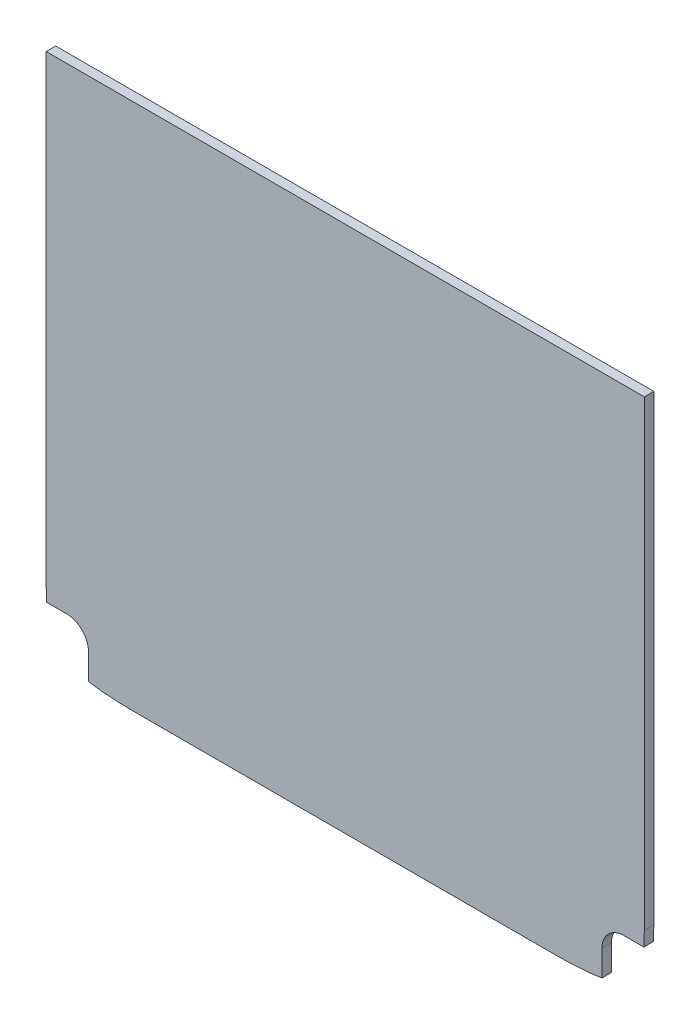
ISO-10303-21;
HEADER;
FILE_DESCRIPTION(('STEP AP214'),'2;1');
FILE_NAME('part.step','',(''),(''),'','','');
FILE_SCHEMA(('AUTOMOTIVE_DESIGN { 1 0 10303 214 1 1 1 1 }'));
ENDSEC;
DATA;
#1=APPLICATION_CONTEXT('core data for automotive mechanical design processes');
#2=APPLICATION_PROTOCOL_DEFINITION('international standard','automotive_design',2000,#1);
#3=PRODUCT_CONTEXT('',#1,'mechanical');
#4=PRODUCT('Part','Part','',(#3));
#5=PRODUCT_RELATED_PRODUCT_CATEGORY('part','',(#4));
#6=PRODUCT_DEFINITION_FORMATION('','',#4);
#7=PRODUCT_DEFINITION_CONTEXT('part definition',#1,'design');
#8=PRODUCT_DEFINITION('design','',#6,#7);
#9=PRODUCT_DEFINITION_SHAPE('','',#8);
#10=(LENGTH_UNIT() NAMED_UNIT(*) SI_UNIT(.MILLI.,.METRE.));
#11=(NAMED_UNIT(*) PLANE_ANGLE_UNIT() SI_UNIT($,.RADIAN.));
#12=(NAMED_UNIT(*) SI_UNIT($,.STERADIAN.) SOLID_ANGLE_UNIT());
#13=UNCERTAINTY_MEASURE_WITH_UNIT(LENGTH_MEASURE(1.E-05),#10,'distance_accuracy_value','');
#14=(GEOMETRIC_REPRESENTATION_CONTEXT(3) GLOBAL_UNCERTAINTY_ASSIGNED_CONTEXT((#13)) GLOBAL_UNIT_ASSIGNED_CONTEXT((#10,
#11,#12)) REPRESENTATION_CONTEXT('',''));
#15=CARTESIAN_POINT('',(0.,0.,0.));
#16=DIRECTION('',(0.,0.,1.));
#17=DIRECTION('',(1.,0.,0.));
#18=AXIS2_PLACEMENT_3D('',#15,#16,#17);
#19=CARTESIAN_POINT('',(-26.9499999999924,-65.5586526538314,2.15));
#20=CARTESIAN_POINT('',(-26.3530525880366,-65.6660159480295,2.15));
#21=CARTESIAN_POINT('',(-25.6657397475612,-65.7491722546854,2.15));
#22=CARTESIAN_POINT('',(-24.0328892150823,-65.8692163600263,2.15));
#23=CARTESIAN_POINT('',(-23.0666253583513,-65.8999999999461,2.15));
#24=CARTESIAN_POINT('',(-21.9999999999962,-65.8999999999461,2.15));
#25=B_SPLINE_CURVE_WITH_KNOTS('',3,(#19,#20,#21,#22,#23,#24),.UNSPECIFIED.,.F.,.F.,(4,2,4),
(0.762959975228664,0.875000000000001,1.),.UNSPECIFIED.);
#26=DIRECTION('',(0.,0.,-1.));
#27=VECTOR('',#26,1.);
#28=SURFACE_OF_LINEAR_EXTRUSION('',#25,#27);
#29=CARTESIAN_POINT('',(-26.9499999999924,-65.5586526538314,1.15));
#30=CARTESIAN_POINT('',(-26.3530525880366,-65.6660159480295,1.15));
#31=CARTESIAN_POINT('',(-25.6657397475612,-65.7491722546854,1.15));
#32=CARTESIAN_POINT('',(-24.0328892150823,-65.8692163600263,1.15));
#33=CARTESIAN_POINT('',(-23.0666253583513,-65.8999999999461,1.15));
#34=CARTESIAN_POINT('',(-21.9999999999962,-65.8999999999461,1.15));
#35=B_SPLINE_CURVE_WITH_KNOTS('',3,(#29,#30,#31,#32,#33,#34),.UNSPECIFIED.,.F.,.F.,(4,2,4),
(0.762959975228664,0.875000000000001,1.),.UNSPECIFIED.);
#36=CARTESIAN_POINT('',(-26.9499999999924,-65.5586526538314,1.15));
#37=VERTEX_POINT('',#36);
#38=CARTESIAN_POINT('',(-21.9999999999962,-65.8999999999461,1.15));
#39=VERTEX_POINT('',#38);
#40=EDGE_CURVE('E166',#37,#39,#35,.T.);
#41=ORIENTED_EDGE('',*,*,#40,.T.);
#42=DIRECTION('',(0.,0.,-1.));
#43=VECTOR('',#42,1.);
#44=CARTESIAN_POINT('',(-21.9999999999962,-65.8999999999461,2.15));
#45=LINE('',#44,#43);
#46=CARTESIAN_POINT('',(-21.9999999999962,-65.8999999999461,2.15));
#47=VERTEX_POINT('',#46);
#48=EDGE_CURVE('E11',#47,#39,#45,.T.);
#49=ORIENTED_EDGE('',*,*,#48,.F.);
#50=CARTESIAN_POINT('',(-26.9499999999924,-65.5586526538314,2.15));
#51=VERTEX_POINT('',#50);
#52=EDGE_CURVE('E212',#51,#47,#25,.T.);
#53=ORIENTED_EDGE('',*,*,#52,.F.);
#54=DIRECTION('',(0.,0.,-1.));
#55=VECTOR('',#54,1.);
#56=CARTESIAN_POINT('',(-26.9499999999924,-65.5586526538314,2.15));
#57=LINE('',#56,#55);
#58=EDGE_CURVE('E162',#51,#37,#57,.T.);
#59=ORIENTED_EDGE('',*,*,#58,.T.);
#60=EDGE_LOOP('',(#41,#49,#53,#59));
#61=FACE_BOUND('',#60,.T.);
#62=ADVANCED_FACE('F33',(#61),#28,.F.);
#63=CARTESIAN_POINT('',(-21.9999999999962,-65.8999999999461,2.15));
#64=DIRECTION('',(0.,1.,0.));
#65=DIRECTION('',(0.,0.,1.));
#66=AXIS2_PLACEMENT_3D('',#63,#64,#65);
#67=PLANE('',#66);
#68=DIRECTION('',(1.,0.,0.));
#69=VECTOR('',#68,1.);
#70=CARTESIAN_POINT('',(-21.9999999999962,-65.8999999999461,1.15));
#71=LINE('',#70,#69);
#72=CARTESIAN_POINT('',(22.0000000000038,-65.8999999999461,1.15));
#73=VERTEX_POINT('',#72);
#74=EDGE_CURVE('E171',#39,#73,#71,.T.);
#75=ORIENTED_EDGE('',*,*,#74,.T.);
#76=DIRECTION('',(0.,0.,-1.));
#77=VECTOR('',#76,1.);
#78=CARTESIAN_POINT('',(22.0000000000038,-65.8999999999461,2.15));
#79=LINE('',#78,#77);
#80=CARTESIAN_POINT('',(22.0000000000038,-65.8999999999461,2.15));
#81=VERTEX_POINT('',#80);
#82=EDGE_CURVE('E42',#81,#73,#79,.T.);
#83=ORIENTED_EDGE('',*,*,#82,.F.);
#84=DIRECTION('',(1.,0.,0.));
#85=VECTOR('',#84,1.);
#86=CARTESIAN_POINT('',(-21.9999999999962,-65.8999999999461,2.15));
#87=LINE('',#86,#85);
#88=EDGE_CURVE('E111',#47,#81,#87,.T.);
#89=ORIENTED_EDGE('',*,*,#88,.F.);
#90=ORIENTED_EDGE('',*,*,#48,.T.);
#91=EDGE_LOOP('',(#75,#83,#89,#90));
#92=FACE_BOUND('',#91,.T.);
#93=ADVANCED_FACE('F296',(#92),#67,.F.);
#94=CARTESIAN_POINT('',(22.0000000000038,-65.8999999999461,2.15));
#95=CARTESIAN_POINT('',(23.0666253583589,-65.8999999999461,2.15));
#96=CARTESIAN_POINT('',(24.0328892150899,-65.8692163600263,2.15));
#97=CARTESIAN_POINT('',(25.6657397475688,-65.7491722546854,2.15));
#98=CARTESIAN_POINT('',(26.3530525880442,-65.6660159480295,2.15));
#99=CARTESIAN_POINT('',(26.95,-65.5586526538314,2.15));
#100=B_SPLINE_CURVE_WITH_KNOTS('',3,(#94,#95,#96,#97,#98,#99),.UNSPECIFIED.,.F.,.F.,(4,2,4),
(0.762959975228664,0.887959975228663,1.),.UNSPECIFIED.);
#101=DIRECTION('',(0.,0.,-1.));
#102=VECTOR('',#101,1.);
#103=SURFACE_OF_LINEAR_EXTRUSION('',#100,#102);
#104=CARTESIAN_POINT('',(22.0000000000038,-65.8999999999461,1.15));
#105=CARTESIAN_POINT('',(23.0666253583589,-65.8999999999461,1.15));
#106=CARTESIAN_POINT('',(24.0328892150899,-65.8692163600263,1.15));
#107=CARTESIAN_POINT('',(25.6657397475688,-65.7491722546854,1.15));
#108=CARTESIAN_POINT('',(26.3530525880442,-65.6660159480295,1.15));
#109=CARTESIAN_POINT('',(26.95,-65.5586526538314,1.15));
#110=B_SPLINE_CURVE_WITH_KNOTS('',3,(#104,#105,#106,#107,#108,#109),.UNSPECIFIED.,.F.,.F.,(4,2,
4),(0.762959975228664,0.887959975228663,1.),.UNSPECIFIED.);
#111=CARTESIAN_POINT('',(26.95,-65.5586526538314,1.15));
#112=VERTEX_POINT('',#111);
#113=EDGE_CURVE('E176',#73,#112,#110,.T.);
#114=ORIENTED_EDGE('',*,*,#113,.T.);
#115=DIRECTION('',(0.,0.,-1.));
#116=VECTOR('',#115,1.);
#117=CARTESIAN_POINT('',(26.95,-65.5586526538314,2.15));
#118=LINE('',#117,#116);
#119=CARTESIAN_POINT('',(26.95,-65.5586526538314,2.15));
#120=VERTEX_POINT('',#119);
#121=EDGE_CURVE('E237',#120,#112,#118,.T.);
#122=ORIENTED_EDGE('',*,*,#121,.F.);
#123=EDGE_CURVE('E245',#81,#120,#100,.T.);
#124=ORIENTED_EDGE('',*,*,#123,.F.);
#125=ORIENTED_EDGE('',*,*,#82,.T.);
#126=EDGE_LOOP('',(#114,#122,#124,#125));
#127=FACE_BOUND('',#126,.T.);
#128=ADVANCED_FACE('F243',(#127),#103,.F.);
#129=CARTESIAN_POINT('',(26.95,-65.5586526538314,2.15));
#130=DIRECTION('',(-1.,0.,0.));
#131=DIRECTION('',(0.,-1.,0.));
#132=AXIS2_PLACEMENT_3D('',#129,#130,#131);
#133=PLANE('',#132);
#134=DIRECTION('',(0.,1.,0.));
#135=VECTOR('',#134,1.);
#136=CARTESIAN_POINT('',(26.95,-65.5586526538314,1.15));
#137=LINE('',#136,#135);
#138=CARTESIAN_POINT('',(26.95,-62.8499999999461,1.15));
#139=VERTEX_POINT('',#138);
#140=EDGE_CURVE('E180',#112,#139,#137,.T.);
#141=ORIENTED_EDGE('',*,*,#140,.T.);
#142=DIRECTION('',(0.,0.,-1.));
#143=VECTOR('',#142,1.);
#144=CARTESIAN_POINT('',(26.95,-62.8499999999461,2.15));
#145=LINE('',#144,#143);
#146=CARTESIAN_POINT('',(26.95,-62.8499999999461,2.15));
#147=VERTEX_POINT('',#146);
#148=EDGE_CURVE('E234',#147,#139,#145,.T.);
#149=ORIENTED_EDGE('',*,*,#148,.F.);
#150=DIRECTION('',(0.,1.,0.));
#151=VECTOR('',#150,1.);
#152=CARTESIAN_POINT('',(26.95,-65.5586526538314,2.15));
#153=LINE('',#152,#151);
#154=EDGE_CURVE('E263',#120,#147,#153,.T.);
#155=ORIENTED_EDGE('',*,*,#154,.F.);
#156=ORIENTED_EDGE('',*,*,#121,.T.);
#157=EDGE_LOOP('',(#141,#149,#155,#156));
#158=FACE_BOUND('',#157,.T.);
#159=ADVANCED_FACE('F254',(#158),#133,.F.);
#160=CARTESIAN_POINT('',(29.25,-62.8499999999461,2.15));
#161=DIRECTION('',(0.,0.,-1.));
#162=DIRECTION('',(-1.,0.,0.));
#163=AXIS2_PLACEMENT_3D('',#160,#161,#162);
#164=CYLINDRICAL_SURFACE('',#163,2.30000000000001);
#165=CARTESIAN_POINT('',(29.25,-62.8499999999461,1.15));
#166=DIRECTION('',(0.,0.,-1.));
#167=DIRECTION('',(1.,0.,0.));
#168=AXIS2_PLACEMENT_3D('',#165,#166,#167);
#169=CIRCLE('',#168,2.30000000000001);
#170=CARTESIAN_POINT('',(29.25,-60.5499999999461,1.15));
#171=VERTEX_POINT('',#170);
#172=EDGE_CURVE('E185',#139,#171,#169,.T.);
#173=ORIENTED_EDGE('',*,*,#172,.T.);
#174=DIRECTION('',(0.,0.,-1.));
#175=VECTOR('',#174,1.);
#176=CARTESIAN_POINT('',(29.25,-60.5499999999461,2.15));
#177=LINE('',#176,#175);
#178=CARTESIAN_POINT('',(29.25,-60.5499999999461,2.15));
#179=VERTEX_POINT('',#178);
#180=EDGE_CURVE('E231',#179,#171,#177,.T.);
#181=ORIENTED_EDGE('',*,*,#180,.F.);
#182=CARTESIAN_POINT('',(29.25,-62.8499999999461,2.15));
#183=DIRECTION('',(0.,0.,-1.));
#184=DIRECTION('',(1.,0.,0.));
#185=AXIS2_PLACEMENT_3D('',#182,#183,#184);
#186=CIRCLE('',#185,2.30000000000001);
#187=EDGE_CURVE('E260',#147,#179,#186,.T.);
#188=ORIENTED_EDGE('',*,*,#187,.F.);
#189=ORIENTED_EDGE('',*,*,#148,.T.);
#190=EDGE_LOOP('',(#173,#181,#188,#189));
#191=FACE_BOUND('',#190,.T.);
#192=ADVANCED_FACE('F258',(#191),#164,.F.);
#193=CARTESIAN_POINT('',(29.25,-60.5499999999461,2.15));
#194=DIRECTION('',(0.,1.,0.));
#195=DIRECTION('',(0.,0.,1.));
#196=AXIS2_PLACEMENT_3D('',#193,#194,#195);
#197=PLANE('',#196);
#198=DIRECTION('',(1.,0.,0.));
#199=VECTOR('',#198,1.);
#200=CARTESIAN_POINT('',(29.25,-60.5499999999461,1.15));
#201=LINE('',#200,#199);
#202=CARTESIAN_POINT('',(31.3422494533232,-60.5499999999461,1.15));
#203=VERTEX_POINT('',#202);
#204=EDGE_CURVE('E187',#171,#203,#201,.T.);
#205=ORIENTED_EDGE('',*,*,#204,.T.);
#206=DIRECTION('',(0.,0.,-1.));
#207=VECTOR('',#206,1.);
#208=CARTESIAN_POINT('',(31.3422494533232,-60.5499999999461,2.15));
#209=LINE('',#208,#207);
#210=CARTESIAN_POINT('',(31.3422494533232,-60.5499999999461,2.15));
#211=VERTEX_POINT('',#210);
#212=EDGE_CURVE('E228',#211,#203,#209,.T.);
#213=ORIENTED_EDGE('',*,*,#212,.F.);
#214=DIRECTION('',(1.,0.,0.));
#215=VECTOR('',#214,1.);
#216=CARTESIAN_POINT('',(29.25,-60.5499999999461,2.15));
#217=LINE('',#216,#215);
#218=EDGE_CURVE('E262',#179,#211,#217,.T.);
#219=ORIENTED_EDGE('',*,*,#218,.F.);
#220=ORIENTED_EDGE('',*,*,#180,.T.);
#221=EDGE_LOOP('',(#205,#213,#219,#220));
#222=FACE_BOUND('',#221,.T.);
#223=ADVANCED_FACE('F285',(#222),#197,.F.);
#224=CARTESIAN_POINT('',(31.3422494533232,-60.5499999999461,2.15));
#225=CARTESIAN_POINT('',(31.3799273594437,-60.0817827199579,2.15));
#226=CARTESIAN_POINT('',(31.4,-59.5647726423221,2.15));
#227=CARTESIAN_POINT('',(31.4,-59.,2.15));
#228=B_SPLINE_CURVE_WITH_KNOTS('',3,(#224,#225,#226,#227),.UNSPECIFIED.,.F.,.F.,(4,4),(0.,
0.0796346763149644),.UNSPECIFIED.);
#229=DIRECTION('',(0.,0.,-1.));
#230=VECTOR('',#229,1.);
#231=SURFACE_OF_LINEAR_EXTRUSION('',#228,#230);
#232=CARTESIAN_POINT('',(31.3422494533232,-60.5499999999461,1.15));
#233=CARTESIAN_POINT('',(31.3799273594437,-60.0817827199579,1.15));
#234=CARTESIAN_POINT('',(31.4,-59.5647726423221,1.15));
#235=CARTESIAN_POINT('',(31.4,-59.,1.15));
#236=B_SPLINE_CURVE_WITH_KNOTS('',3,(#232,#233,#234,#235),.UNSPECIFIED.,.F.,.F.,(4,4),(0.,
0.0796346763149644),.UNSPECIFIED.);
#237=CARTESIAN_POINT('',(31.4,-59.,1.15));
#238=VERTEX_POINT('',#237);
#239=EDGE_CURVE('E189',#203,#238,#236,.T.);
#240=ORIENTED_EDGE('',*,*,#239,.T.);
#241=DIRECTION('',(0.,0.,-1.));
#242=VECTOR('',#241,1.);
#243=CARTESIAN_POINT('',(31.4,-59.,2.15));
#244=LINE('',#243,#242);
#245=CARTESIAN_POINT('',(31.4,-59.,2.15));
#246=VERTEX_POINT('',#245);
#247=EDGE_CURVE('E225',#246,#238,#244,.T.);
#248=ORIENTED_EDGE('',*,*,#247,.F.);
#249=EDGE_CURVE('E265',#211,#246,#228,.T.);
#250=ORIENTED_EDGE('',*,*,#249,.F.);
#251=ORIENTED_EDGE('',*,*,#212,.T.);
#252=EDGE_LOOP('',(#240,#248,#250,#251));
#253=FACE_BOUND('',#252,.T.);
#254=ADVANCED_FACE('F280',(#253),#231,.F.);
#255=CARTESIAN_POINT('',(31.4,-59.,2.15));
#256=DIRECTION('',(-1.,0.,0.));
#257=DIRECTION('',(0.,0.,1.));
#258=AXIS2_PLACEMENT_3D('',#255,#256,#257);
#259=PLANE('',#258);
#260=DIRECTION('',(0.,1.,0.));
#261=VECTOR('',#260,1.);
#262=CARTESIAN_POINT('',(31.4,-59.,1.15));
#263=LINE('',#262,#261);
#264=CARTESIAN_POINT('',(31.4,-10.5,1.15));
#265=VERTEX_POINT('',#264);
#266=EDGE_CURVE('E193',#238,#265,#263,.T.);
#267=ORIENTED_EDGE('',*,*,#266,.T.);
#268=DIRECTION('',(0.,0.,-1.));
#269=VECTOR('',#268,1.);
#270=CARTESIAN_POINT('',(31.4,-10.5,2.15));
#271=LINE('',#270,#269);
#272=CARTESIAN_POINT('',(31.4,-10.5,2.15));
#273=VERTEX_POINT('',#272);
#274=EDGE_CURVE('E222',#273,#265,#271,.T.);
#275=ORIENTED_EDGE('',*,*,#274,.F.);
#276=DIRECTION('',(0.,1.,0.));
#277=VECTOR('',#276,1.);
#278=CARTESIAN_POINT('',(31.4,-59.,2.15));
#279=LINE('',#278,#277);
#280=EDGE_CURVE('E274',#246,#273,#279,.T.);
#281=ORIENTED_EDGE('',*,*,#280,.F.);
#282=ORIENTED_EDGE('',*,*,#247,.T.);
#283=EDGE_LOOP('',(#267,#275,#281,#282));
#284=FACE_BOUND('',#283,.T.);
#285=ADVANCED_FACE('F284',(#284),#259,.F.);
#286=CARTESIAN_POINT('',(31.4,-10.5,2.15));
#287=DIRECTION('',(0.,-1.,0.));
#288=DIRECTION('',(1.,0.,0.));
#289=AXIS2_PLACEMENT_3D('',#286,#287,#288);
#290=PLANE('',#289);
#291=DIRECTION('',(-1.,0.,0.));
#292=VECTOR('',#291,1.);
#293=CARTESIAN_POINT('',(31.4,-10.5,1.15));
#294=LINE('',#293,#292);
#295=CARTESIAN_POINT('',(-31.3999999999924,-10.5,1.15));
#296=VERTEX_POINT('',#295);
#297=EDGE_CURVE('E198',#265,#296,#294,.T.);
#298=ORIENTED_EDGE('',*,*,#297,.T.);
#299=DIRECTION('',(0.,0.,-1.));
#300=VECTOR('',#299,1.);
#301=CARTESIAN_POINT('',(-31.3999999999924,-10.5,2.15));
#302=LINE('',#301,#300);
#303=CARTESIAN_POINT('',(-31.3999999999924,-10.5,2.15));
#304=VERTEX_POINT('',#303);
#305=EDGE_CURVE('E219',#304,#296,#302,.T.);
#306=ORIENTED_EDGE('',*,*,#305,.F.);
#307=DIRECTION('',(-1.,0.,0.));
#308=VECTOR('',#307,1.);
#309=CARTESIAN_POINT('',(31.4,-10.5,2.15));
#310=LINE('',#309,#308);
#311=EDGE_CURVE('E443',#273,#304,#310,.T.);
#312=ORIENTED_EDGE('',*,*,#311,.F.);
#313=ORIENTED_EDGE('',*,*,#274,.T.);
#314=EDGE_LOOP('',(#298,#306,#312,#313));
#315=FACE_BOUND('',#314,.T.);
#316=ADVANCED_FACE('F362',(#315),#290,.F.);
#317=CARTESIAN_POINT('',(-31.3999999999924,-10.5,2.15));
#318=DIRECTION('',(1.,0.,0.));
#319=DIRECTION('',(0.,0.,-1.));
#320=AXIS2_PLACEMENT_3D('',#317,#318,#319);
#321=PLANE('',#320);
#322=DIRECTION('',(0.,-1.,0.));
#323=VECTOR('',#322,1.);
#324=CARTESIAN_POINT('',(-31.3999999999924,-10.5,1.15));
#325=LINE('',#324,#323);
#326=CARTESIAN_POINT('',(-31.3999999999924,-59.,1.15));
#327=VERTEX_POINT('',#326);
#328=EDGE_CURVE('E200',#296,#327,#325,.T.);
#329=ORIENTED_EDGE('',*,*,#328,.T.);
#330=DIRECTION('',(0.,0.,-1.));
#331=VECTOR('',#330,1.);
#332=CARTESIAN_POINT('',(-31.3999999999924,-59.,2.15));
#333=LINE('',#332,#331);
#334=CARTESIAN_POINT('',(-31.3999999999924,-59.,2.15));
#335=VERTEX_POINT('',#334);
#336=EDGE_CURVE('E216',#335,#327,#333,.T.);
#337=ORIENTED_EDGE('',*,*,#336,.F.);
#338=DIRECTION('',(0.,-1.,0.));
#339=VECTOR('',#338,1.);
#340=CARTESIAN_POINT('',(-31.3999999999924,-10.5,2.15));
#341=LINE('',#340,#339);
#342=EDGE_CURVE('E439',#304,#335,#341,.T.);
#343=ORIENTED_EDGE('',*,*,#342,.F.);
#344=ORIENTED_EDGE('',*,*,#305,.T.);
#345=EDGE_LOOP('',(#329,#337,#343,#344));
#346=FACE_BOUND('',#345,.T.);
#347=ADVANCED_FACE('F371',(#346),#321,.F.);
#348=CARTESIAN_POINT('',(-31.3999999999924,-59.,2.15));
#349=CARTESIAN_POINT('',(-31.3999999999924,-59.5647726423221,2.15));
#350=CARTESIAN_POINT('',(-31.379927359436,-60.0817827199579,2.15));
#351=CARTESIAN_POINT('',(-31.3422494533156,-60.5499999999461,2.15));
#352=B_SPLINE_CURVE_WITH_KNOTS('',3,(#348,#349,#350,#351),.UNSPECIFIED.,.F.,.F.,(4,4),(0.,
0.0796346763149644),.UNSPECIFIED.);
#353=DIRECTION('',(0.,0.,-1.));
#354=VECTOR('',#353,1.);
#355=SURFACE_OF_LINEAR_EXTRUSION('',#352,#354);
#356=CARTESIAN_POINT('',(-31.3999999999924,-59.,1.15));
#357=CARTESIAN_POINT('',(-31.3999999999924,-59.5647726423221,1.15));
#358=CARTESIAN_POINT('',(-31.379927359436,-60.0817827199579,1.15));
#359=CARTESIAN_POINT('',(-31.3422494533156,-60.5499999999461,1.15));
#360=B_SPLINE_CURVE_WITH_KNOTS('',3,(#356,#357,#358,#359),.UNSPECIFIED.,.F.,.F.,(4,4),(0.,
0.0796346763149644),.UNSPECIFIED.);
#361=CARTESIAN_POINT('',(-31.3422494533156,-60.5499999999461,1.15));
#362=VERTEX_POINT('',#361);
#363=EDGE_CURVE('E202',#327,#362,#360,.T.);
#364=ORIENTED_EDGE('',*,*,#363,.T.);
#365=DIRECTION('',(0.,0.,-1.));
#366=VECTOR('',#365,1.);
#367=CARTESIAN_POINT('',(-31.3422494533156,-60.5499999999461,2.15));
#368=LINE('',#367,#366);
#369=CARTESIAN_POINT('',(-31.3422494533156,-60.5499999999461,2.15));
#370=VERTEX_POINT('',#369);
#371=EDGE_CURVE('E157',#370,#362,#368,.T.);
#372=ORIENTED_EDGE('',*,*,#371,.F.);
#373=EDGE_CURVE('E148',#335,#370,#352,.T.);
#374=ORIENTED_EDGE('',*,*,#373,.F.);
#375=ORIENTED_EDGE('',*,*,#336,.T.);
#376=EDGE_LOOP('',(#364,#372,#374,#375));
#377=FACE_BOUND('',#376,.T.);
#378=ADVANCED_FACE('F380',(#377),#355,.F.);
#379=CARTESIAN_POINT('',(-31.3422494533156,-60.5499999999461,2.15));
#380=DIRECTION('',(0.,1.,0.));
#381=DIRECTION('',(0.,0.,1.));
#382=AXIS2_PLACEMENT_3D('',#379,#380,#381);
#383=PLANE('',#382);
#384=DIRECTION('',(1.,0.,0.));
#385=VECTOR('',#384,1.);
#386=CARTESIAN_POINT('',(-31.3422494533156,-60.5499999999461,1.15));
#387=LINE('',#386,#385);
#388=CARTESIAN_POINT('',(-29.2499999999924,-60.5499999999461,1.15));
#389=VERTEX_POINT('',#388);
#390=EDGE_CURVE('E156',#362,#389,#387,.T.);
#391=ORIENTED_EDGE('',*,*,#390,.T.);
#392=DIRECTION('',(0.,0.,-1.));
#393=VECTOR('',#392,1.);
#394=CARTESIAN_POINT('',(-29.2499999999924,-60.5499999999461,2.15));
#395=LINE('',#394,#393);
#396=CARTESIAN_POINT('',(-29.2499999999924,-60.5499999999461,2.15));
#397=VERTEX_POINT('',#396);
#398=EDGE_CURVE('E153',#397,#389,#395,.T.);
#399=ORIENTED_EDGE('',*,*,#398,.F.);
#400=DIRECTION('',(1.,0.,0.));
#401=VECTOR('',#400,1.);
#402=CARTESIAN_POINT('',(-31.3422494533156,-60.5499999999461,2.15));
#403=LINE('',#402,#401);
#404=EDGE_CURVE('E142',#370,#397,#403,.T.);
#405=ORIENTED_EDGE('',*,*,#404,.F.);
#406=ORIENTED_EDGE('',*,*,#371,.T.);
#407=EDGE_LOOP('',(#391,#399,#405,#406));
#408=FACE_BOUND('',#407,.T.);
#409=ADVANCED_FACE('F154',(#408),#383,.F.);
#410=CARTESIAN_POINT('',(-29.2499999999924,-62.8499999999461,2.15));
#411=DIRECTION('',(0.,0.,-1.));
#412=DIRECTION('',(-1.,0.,0.));
#413=AXIS2_PLACEMENT_3D('',#410,#411,#412);
#414=CYLINDRICAL_SURFACE('',#413,2.3);
#415=CARTESIAN_POINT('',(-29.2499999999924,-62.8499999999461,1.15));
#416=DIRECTION('',(0.,0.,-1.));
#417=DIRECTION('',(1.,0.,0.));
#418=AXIS2_PLACEMENT_3D('',#415,#416,#417);
#419=CIRCLE('',#418,2.3);
#420=CARTESIAN_POINT('',(-26.9499999999924,-62.8499999999461,1.15));
#421=VERTEX_POINT('',#420);
#422=EDGE_CURVE('E97',#389,#421,#419,.T.);
#423=ORIENTED_EDGE('',*,*,#422,.T.);
#424=DIRECTION('',(0.,0.,-1.));
#425=VECTOR('',#424,1.);
#426=CARTESIAN_POINT('',(-26.9499999999924,-62.8499999999461,2.15));
#427=LINE('',#426,#425);
#428=CARTESIAN_POINT('',(-26.9499999999924,-62.8499999999461,2.15));
#429=VERTEX_POINT('',#428);
#430=EDGE_CURVE('E158',#429,#421,#427,.T.);
#431=ORIENTED_EDGE('',*,*,#430,.F.);
#432=CARTESIAN_POINT('',(-29.2499999999924,-62.8499999999461,2.15));
#433=DIRECTION('',(0.,0.,-1.));
#434=DIRECTION('',(1.,0.,0.));
#435=AXIS2_PLACEMENT_3D('',#432,#433,#434);
#436=CIRCLE('',#435,2.3);
#437=EDGE_CURVE('E146',#397,#429,#436,.T.);
#438=ORIENTED_EDGE('',*,*,#437,.F.);
#439=ORIENTED_EDGE('',*,*,#398,.T.);
#440=EDGE_LOOP('',(#423,#431,#438,#439));
#441=FACE_BOUND('',#440,.T.);
#442=ADVANCED_FACE('F160',(#441),#414,.F.);
#443=CARTESIAN_POINT('',(-26.9499999999924,-62.8499999999461,2.15));
#444=DIRECTION('',(1.,0.,0.));
#445=DIRECTION('',(0.,0.,-1.));
#446=AXIS2_PLACEMENT_3D('',#443,#444,#445);
#447=PLANE('',#446);
#448=DIRECTION('',(0.,-1.,0.));
#449=VECTOR('',#448,1.);
#450=CARTESIAN_POINT('',(-26.9499999999924,-62.8499999999461,1.15));
#451=LINE('',#450,#449);
#452=EDGE_CURVE('E103',#421,#37,#451,.T.);
#453=ORIENTED_EDGE('',*,*,#452,.T.);
#454=ORIENTED_EDGE('',*,*,#58,.F.);
#455=DIRECTION('',(0.,-1.,0.));
#456=VECTOR('',#455,1.);
#457=CARTESIAN_POINT('',(-26.9499999999924,-62.8499999999461,2.15));
#458=LINE('',#457,#456);
#459=EDGE_CURVE('E50',#429,#51,#458,.T.);
#460=ORIENTED_EDGE('',*,*,#459,.F.);
#461=ORIENTED_EDGE('',*,*,#430,.T.);
#462=EDGE_LOOP('',(#453,#454,#460,#461));
#463=FACE_BOUND('',#462,.T.);
#464=ADVANCED_FACE('F407',(#463),#447,.F.);
#465=CARTESIAN_POINT('',(-24.7591922033721,-65.8154956845428,2.15));
#466=DIRECTION('',(0.,0.,-1.));
#467=DIRECTION('',(-1.,0.,0.));
#468=AXIS2_PLACEMENT_3D('',#465,#466,#467);
#469=PLANE('',#468);
#470=ORIENTED_EDGE('',*,*,#52,.T.);
#471=ORIENTED_EDGE('',*,*,#88,.T.);
#472=ORIENTED_EDGE('',*,*,#123,.T.);
#473=ORIENTED_EDGE('',*,*,#154,.T.);
#474=ORIENTED_EDGE('',*,*,#187,.T.);
#475=ORIENTED_EDGE('',*,*,#218,.T.);
#476=ORIENTED_EDGE('',*,*,#249,.T.);
#477=ORIENTED_EDGE('',*,*,#280,.T.);
#478=ORIENTED_EDGE('',*,*,#311,.T.);
#479=ORIENTED_EDGE('',*,*,#342,.T.);
#480=ORIENTED_EDGE('',*,*,#373,.T.);
#481=ORIENTED_EDGE('',*,*,#404,.T.);
#482=ORIENTED_EDGE('',*,*,#437,.T.);
#483=ORIENTED_EDGE('',*,*,#459,.T.);
#484=EDGE_LOOP('',(#470,#471,#472,#473,#474,#475,#476,#477,#478,#479,#480,#481,#482,#483));
#485=FACE_BOUND('',#484,.T.);
#486=ADVANCED_FACE('F144',(#485),#469,.F.);
#487=CARTESIAN_POINT('',(-24.7591922033721,-65.8154956845428,1.15));
#488=DIRECTION('',(0.,0.,-1.));
#489=DIRECTION('',(-1.,0.,0.));
#490=AXIS2_PLACEMENT_3D('',#487,#488,#489);
#491=PLANE('',#490);
#492=ORIENTED_EDGE('',*,*,#40,.F.);
#493=ORIENTED_EDGE('',*,*,#452,.F.);
#494=ORIENTED_EDGE('',*,*,#422,.F.);
#495=ORIENTED_EDGE('',*,*,#390,.F.);
#496=ORIENTED_EDGE('',*,*,#363,.F.);
#497=ORIENTED_EDGE('',*,*,#328,.F.);
#498=ORIENTED_EDGE('',*,*,#297,.F.);
#499=ORIENTED_EDGE('',*,*,#266,.F.);
#500=ORIENTED_EDGE('',*,*,#239,.F.);
#501=ORIENTED_EDGE('',*,*,#204,.F.);
#502=ORIENTED_EDGE('',*,*,#172,.F.);
#503=ORIENTED_EDGE('',*,*,#140,.F.);
#504=ORIENTED_EDGE('',*,*,#113,.F.);
#505=ORIENTED_EDGE('',*,*,#74,.F.);
#506=EDGE_LOOP('',(#492,#493,#494,#495,#496,#497,#498,#499,#500,#501,#502,#503,#504,#505));
#507=FACE_BOUND('',#506,.T.);
#508=ADVANCED_FACE('F249',(#507),#491,.T.);
#509=CLOSED_SHELL('',(#62,#93,#128,#159,#192,#223,#254,#285,#316,#347,#378,#409,#442,#464,#486,#508));
#510=MANIFOLD_SOLID_BREP('B2',#509);
#511=ADVANCED_BREP_SHAPE_REPRESENTATION('',(#18,#510),#14);
#512=SHAPE_DEFINITION_REPRESENTATION(#9,#511);
ENDSEC;
END-ISO-10303-21;
